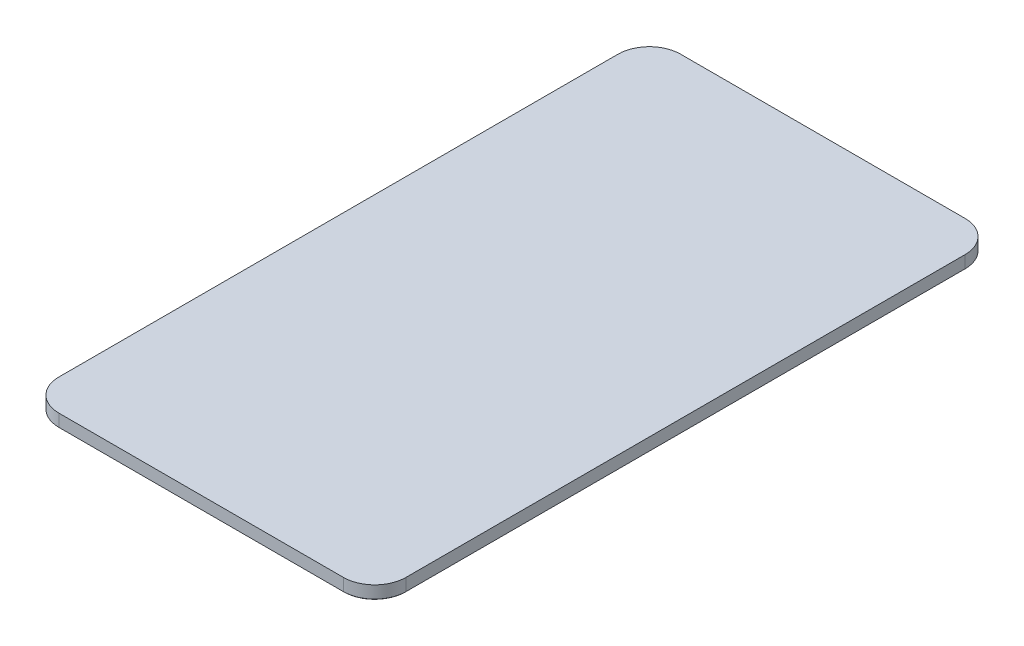
ISO-10303-21;
HEADER;
FILE_DESCRIPTION(('STEP AP214'),'2;1');
FILE_NAME('part.step','',(''),(''),'','','');
FILE_SCHEMA(('AUTOMOTIVE_DESIGN { 1 0 10303 214 1 1 1 1 }'));
ENDSEC;
DATA;
#1=APPLICATION_CONTEXT('core data for automotive mechanical design processes');
#2=APPLICATION_PROTOCOL_DEFINITION('international standard','automotive_design',2000,#1);
#3=PRODUCT_CONTEXT('',#1,'mechanical');
#4=PRODUCT('Part','Part','',(#3));
#5=PRODUCT_RELATED_PRODUCT_CATEGORY('part','',(#4));
#6=PRODUCT_DEFINITION_FORMATION('','',#4);
#7=PRODUCT_DEFINITION_CONTEXT('part definition',#1,'design');
#8=PRODUCT_DEFINITION('design','',#6,#7);
#9=PRODUCT_DEFINITION_SHAPE('','',#8);
#10=(LENGTH_UNIT() NAMED_UNIT(*) SI_UNIT(.MILLI.,.METRE.));
#11=(NAMED_UNIT(*) PLANE_ANGLE_UNIT() SI_UNIT($,.RADIAN.));
#12=(NAMED_UNIT(*) SI_UNIT($,.STERADIAN.) SOLID_ANGLE_UNIT());
#13=UNCERTAINTY_MEASURE_WITH_UNIT(LENGTH_MEASURE(1.E-05),#10,'distance_accuracy_value','');
#14=(GEOMETRIC_REPRESENTATION_CONTEXT(3) GLOBAL_UNCERTAINTY_ASSIGNED_CONTEXT((#13)) GLOBAL_UNIT_ASSIGNED_CONTEXT((#10,
#11,#12)) REPRESENTATION_CONTEXT('',''));
#15=CARTESIAN_POINT('',(0.,0.,0.));
#16=DIRECTION('',(0.,0.,1.));
#17=DIRECTION('',(1.,0.,0.));
#18=AXIS2_PLACEMENT_3D('',#15,#16,#17);
#19=CARTESIAN_POINT('',(0.,5.969,0.));
#20=DIRECTION('',(1.,0.,0.));
#21=DIRECTION('',(0.,0.,-1.));
#22=AXIS2_PLACEMENT_3D('',#19,#20,#21);
#23=PLANE('',#22);
#24=DIRECTION('',(0.,-1.,0.));
#25=VECTOR('',#24,1.);
#26=CARTESIAN_POINT('',(0.,5.969,-273.05));
#27=LINE('',#26,#25);
#28=CARTESIAN_POINT('',(0.,5.969,-273.05));
#29=VERTEX_POINT('',#28);
#30=CARTESIAN_POINT('',(0.,0.254000000000004,-273.05));
#31=VERTEX_POINT('',#30);
#32=EDGE_CURVE('E159',#29,#31,#27,.T.);
#33=ORIENTED_EDGE('',*,*,#32,.T.);
#34=DIRECTION('',(0.,0.,1.));
#35=VECTOR('',#34,1.);
#36=CARTESIAN_POINT('',(0.,0.254000000000004,-14.478));
#37=LINE('',#36,#35);
#38=CARTESIAN_POINT('',(0.,0.254000000000004,-14.478));
#39=VERTEX_POINT('',#38);
#40=EDGE_CURVE('E188',#31,#39,#37,.T.);
#41=ORIENTED_EDGE('',*,*,#40,.T.);
#42=DIRECTION('',(0.,-1.,0.));
#43=VECTOR('',#42,1.);
#44=CARTESIAN_POINT('',(0.,5.969,-14.478));
#45=LINE('',#44,#43);
#46=CARTESIAN_POINT('',(0.,5.969,-14.478));
#47=VERTEX_POINT('',#46);
#48=EDGE_CURVE('E162',#39,#47,#45,.F.);
#49=ORIENTED_EDGE('',*,*,#48,.T.);
#50=DIRECTION('',(0.,0.,1.));
#51=VECTOR('',#50,1.);
#52=CARTESIAN_POINT('',(0.,5.969,0.));
#53=LINE('',#52,#51);
#54=EDGE_CURVE('E217',#29,#47,#53,.T.);
#55=ORIENTED_EDGE('',*,*,#54,.F.);
#56=EDGE_LOOP('',(#33,#41,#49,#55));
#57=FACE_BOUND('',#56,.T.);
#58=ADVANCED_FACE('F34',(#57),#23,.F.);
#59=CARTESIAN_POINT('',(0.,5.969,0.));
#60=DIRECTION('',(0.,0.,-1.));
#61=DIRECTION('',(-1.,0.,0.));
#62=AXIS2_PLACEMENT_3D('',#59,#60,#61);
#63=PLANE('',#62);
#64=DIRECTION('',(0.,-1.,0.));
#65=VECTOR('',#64,1.);
#66=CARTESIAN_POINT('',(14.478,5.969,0.));
#67=LINE('',#66,#65);
#68=CARTESIAN_POINT('',(14.478,5.969,0.));
#69=VERTEX_POINT('',#68);
#70=CARTESIAN_POINT('',(14.478,0.254000000000004,0.));
#71=VERTEX_POINT('',#70);
#72=EDGE_CURVE('E132',#69,#71,#67,.T.);
#73=ORIENTED_EDGE('',*,*,#72,.T.);
#74=DIRECTION('',(1.,0.,0.));
#75=VECTOR('',#74,1.);
#76=CARTESIAN_POINT('',(146.05,0.254000000000004,0.));
#77=LINE('',#76,#75);
#78=CARTESIAN_POINT('',(146.05,0.254000000000004,0.));
#79=VERTEX_POINT('',#78);
#80=EDGE_CURVE('E184',#71,#79,#77,.T.);
#81=ORIENTED_EDGE('',*,*,#80,.T.);
#82=DIRECTION('',(0.,-1.,0.));
#83=VECTOR('',#82,1.);
#84=CARTESIAN_POINT('',(146.05,5.969,0.));
#85=LINE('',#84,#83);
#86=CARTESIAN_POINT('',(146.05,5.969,0.));
#87=VERTEX_POINT('',#86);
#88=EDGE_CURVE('E157',#79,#87,#85,.F.);
#89=ORIENTED_EDGE('',*,*,#88,.T.);
#90=DIRECTION('',(1.,0.,0.));
#91=VECTOR('',#90,1.);
#92=CARTESIAN_POINT('',(0.,5.969,0.));
#93=LINE('',#92,#91);
#94=EDGE_CURVE('E222',#69,#87,#93,.T.);
#95=ORIENTED_EDGE('',*,*,#94,.F.);
#96=EDGE_LOOP('',(#73,#81,#89,#95));
#97=FACE_BOUND('',#96,.T.);
#98=ADVANCED_FACE('F266',(#97),#63,.F.);
#99=CARTESIAN_POINT('',(160.528,5.969,0.));
#100=DIRECTION('',(-1.,0.,0.));
#101=DIRECTION('',(0.,0.,1.));
#102=AXIS2_PLACEMENT_3D('',#99,#100,#101);
#103=PLANE('',#102);
#104=DIRECTION('',(0.,-1.,0.));
#105=VECTOR('',#104,1.);
#106=CARTESIAN_POINT('',(160.528,5.969,-14.478));
#107=LINE('',#106,#105);
#108=CARTESIAN_POINT('',(160.528,5.969,-14.478));
#109=VERTEX_POINT('',#108);
#110=CARTESIAN_POINT('',(160.528,0.254000000000004,-14.478));
#111=VERTEX_POINT('',#110);
#112=EDGE_CURVE('E143',#109,#111,#107,.T.);
#113=ORIENTED_EDGE('',*,*,#112,.T.);
#114=DIRECTION('',(0.,0.,-1.));
#115=VECTOR('',#114,1.);
#116=CARTESIAN_POINT('',(160.528,0.254000000000004,-273.05));
#117=LINE('',#116,#115);
#118=CARTESIAN_POINT('',(160.528,0.254000000000004,-273.05));
#119=VERTEX_POINT('',#118);
#120=EDGE_CURVE('E11',#111,#119,#117,.T.);
#121=ORIENTED_EDGE('',*,*,#120,.T.);
#122=DIRECTION('',(0.,-1.,0.));
#123=VECTOR('',#122,1.);
#124=CARTESIAN_POINT('',(160.528,5.969,-273.05));
#125=LINE('',#124,#123);
#126=CARTESIAN_POINT('',(160.528,5.969,-273.05));
#127=VERTEX_POINT('',#126);
#128=EDGE_CURVE('E145',#119,#127,#125,.F.);
#129=ORIENTED_EDGE('',*,*,#128,.T.);
#130=DIRECTION('',(0.,0.,-1.));
#131=VECTOR('',#130,1.);
#132=CARTESIAN_POINT('',(160.528,5.969,0.));
#133=LINE('',#132,#131);
#134=EDGE_CURVE('E131',#109,#127,#133,.T.);
#135=ORIENTED_EDGE('',*,*,#134,.F.);
#136=EDGE_LOOP('',(#113,#121,#129,#135));
#137=FACE_BOUND('',#136,.T.);
#138=ADVANCED_FACE('F238',(#137),#103,.F.);
#139=CARTESIAN_POINT('',(0.,5.969,-287.528));
#140=DIRECTION('',(0.,0.,1.));
#141=DIRECTION('',(1.,0.,0.));
#142=AXIS2_PLACEMENT_3D('',#139,#140,#141);
#143=PLANE('',#142);
#144=DIRECTION('',(0.,-1.,0.));
#145=VECTOR('',#144,1.);
#146=CARTESIAN_POINT('',(146.05,5.969,-287.528));
#147=LINE('',#146,#145);
#148=CARTESIAN_POINT('',(146.05,5.969,-287.528));
#149=VERTEX_POINT('',#148);
#150=CARTESIAN_POINT('',(146.05,0.254000000000004,-287.528));
#151=VERTEX_POINT('',#150);
#152=EDGE_CURVE('E137',#149,#151,#147,.T.);
#153=ORIENTED_EDGE('',*,*,#152,.T.);
#154=DIRECTION('',(-1.,0.,0.));
#155=VECTOR('',#154,1.);
#156=CARTESIAN_POINT('',(14.478,0.254000000000004,-287.528));
#157=LINE('',#156,#155);
#158=CARTESIAN_POINT('',(14.478,0.254000000000004,-287.528));
#159=VERTEX_POINT('',#158);
#160=EDGE_CURVE('E192',#151,#159,#157,.T.);
#161=ORIENTED_EDGE('',*,*,#160,.T.);
#162=DIRECTION('',(0.,-1.,0.));
#163=VECTOR('',#162,1.);
#164=CARTESIAN_POINT('',(14.478,5.969,-287.528));
#165=LINE('',#164,#163);
#166=CARTESIAN_POINT('',(14.478,5.969,-287.528));
#167=VERTEX_POINT('',#166);
#168=EDGE_CURVE('E140',#159,#167,#165,.F.);
#169=ORIENTED_EDGE('',*,*,#168,.T.);
#170=DIRECTION('',(-1.,0.,0.));
#171=VECTOR('',#170,1.);
#172=CARTESIAN_POINT('',(0.,5.969,-287.528));
#173=LINE('',#172,#171);
#174=EDGE_CURVE('E128',#149,#167,#173,.T.);
#175=ORIENTED_EDGE('',*,*,#174,.F.);
#176=EDGE_LOOP('',(#153,#161,#169,#175));
#177=FACE_BOUND('',#176,.T.);
#178=ADVANCED_FACE('F136',(#177),#143,.F.);
#179=CARTESIAN_POINT('',(0.,5.969,0.));
#180=DIRECTION('',(0.,-1.,0.));
#181=DIRECTION('',(0.,0.,-1.));
#182=AXIS2_PLACEMENT_3D('',#179,#180,#181);
#183=PLANE('',#182);
#184=ORIENTED_EDGE('',*,*,#134,.T.);
#185=CARTESIAN_POINT('',(146.05,5.969,-273.05));
#186=DIRECTION('',(0.,-1.,0.));
#187=DIRECTION('',(0.,0.,-1.));
#188=AXIS2_PLACEMENT_3D('',#185,#186,#187);
#189=CIRCLE('',#188,14.478);
#190=EDGE_CURVE('E125',#127,#149,#189,.F.);
#191=ORIENTED_EDGE('',*,*,#190,.T.);
#192=ORIENTED_EDGE('',*,*,#174,.T.);
#193=CARTESIAN_POINT('',(14.478,5.969,-273.05));
#194=DIRECTION('',(0.,-1.,0.));
#195=DIRECTION('',(0.,0.,-1.));
#196=AXIS2_PLACEMENT_3D('',#193,#194,#195);
#197=CIRCLE('',#196,14.478);
#198=EDGE_CURVE('E150',#167,#29,#197,.F.);
#199=ORIENTED_EDGE('',*,*,#198,.T.);
#200=ORIENTED_EDGE('',*,*,#54,.T.);
#201=CARTESIAN_POINT('',(14.478,5.969,-14.478));
#202=DIRECTION('',(0.,-1.,0.));
#203=DIRECTION('',(0.,0.,-1.));
#204=AXIS2_PLACEMENT_3D('',#201,#202,#203);
#205=CIRCLE('',#204,14.478);
#206=EDGE_CURVE('E152',#47,#69,#205,.F.);
#207=ORIENTED_EDGE('',*,*,#206,.T.);
#208=ORIENTED_EDGE('',*,*,#94,.T.);
#209=CARTESIAN_POINT('',(146.05,5.969,-14.478));
#210=DIRECTION('',(0.,-1.,0.));
#211=DIRECTION('',(0.,0.,-1.));
#212=AXIS2_PLACEMENT_3D('',#209,#210,#211);
#213=CIRCLE('',#212,14.478);
#214=EDGE_CURVE('E133',#87,#109,#213,.F.);
#215=ORIENTED_EDGE('',*,*,#214,.T.);
#216=EDGE_LOOP('',(#184,#191,#192,#199,#200,#207,#208,#215));
#217=FACE_BOUND('',#216,.T.);
#218=ADVANCED_FACE('F127',(#217),#183,.F.);
#219=CARTESIAN_POINT('',(0.,0.,0.));
#220=DIRECTION('',(0.,-1.,0.));
#221=DIRECTION('',(0.,0.,-1.));
#222=AXIS2_PLACEMENT_3D('',#219,#220,#221);
#223=PLANE('',#222);
#224=DIRECTION('',(0.,0.,1.));
#225=VECTOR('',#224,1.);
#226=CARTESIAN_POINT('',(160.274,0.,-14.478));
#227=LINE('',#226,#225);
#228=CARTESIAN_POINT('',(160.274,0.,-273.05));
#229=VERTEX_POINT('',#228);
#230=CARTESIAN_POINT('',(160.274,0.,-14.478));
#231=VERTEX_POINT('',#230);
#232=EDGE_CURVE('E164',#229,#231,#227,.T.);
#233=ORIENTED_EDGE('',*,*,#232,.T.);
#234=CARTESIAN_POINT('',(146.05,0.,-14.478));
#235=DIRECTION('',(0.,-1.,0.));
#236=DIRECTION('',(0.,0.,-1.));
#237=AXIS2_PLACEMENT_3D('',#234,#235,#236);
#238=CIRCLE('',#237,14.224);
#239=CARTESIAN_POINT('',(146.05,0.,-0.254000000000004));
#240=VERTEX_POINT('',#239);
#241=EDGE_CURVE('E178',#231,#240,#238,.T.);
#242=ORIENTED_EDGE('',*,*,#241,.T.);
#243=DIRECTION('',(-1.,0.,0.));
#244=VECTOR('',#243,1.);
#245=CARTESIAN_POINT('',(14.478,0.,-0.254000000000004));
#246=LINE('',#245,#244);
#247=CARTESIAN_POINT('',(14.478,0.,-0.254000000000004));
#248=VERTEX_POINT('',#247);
#249=EDGE_CURVE('E176',#240,#248,#246,.T.);
#250=ORIENTED_EDGE('',*,*,#249,.T.);
#251=CARTESIAN_POINT('',(14.478,0.,-14.478));
#252=DIRECTION('',(0.,-1.,0.));
#253=DIRECTION('',(0.,0.,-1.));
#254=AXIS2_PLACEMENT_3D('',#251,#252,#253);
#255=CIRCLE('',#254,14.224);
#256=CARTESIAN_POINT('',(0.254000000000004,0.,-14.478));
#257=VERTEX_POINT('',#256);
#258=EDGE_CURVE('E174',#248,#257,#255,.T.);
#259=ORIENTED_EDGE('',*,*,#258,.T.);
#260=DIRECTION('',(0.,0.,-1.));
#261=VECTOR('',#260,1.);
#262=CARTESIAN_POINT('',(0.254000000000004,0.,-273.05));
#263=LINE('',#262,#261);
#264=CARTESIAN_POINT('',(0.253999999999983,0.,-273.05));
#265=VERTEX_POINT('',#264);
#266=EDGE_CURVE('E172',#257,#265,#263,.T.);
#267=ORIENTED_EDGE('',*,*,#266,.T.);
#268=CARTESIAN_POINT('',(14.478,0.,-273.05));
#269=DIRECTION('',(0.,-1.,0.));
#270=DIRECTION('',(0.,0.,-1.));
#271=AXIS2_PLACEMENT_3D('',#268,#269,#270);
#272=CIRCLE('',#271,14.224);
#273=CARTESIAN_POINT('',(14.478,0.,-287.274));
#274=VERTEX_POINT('',#273);
#275=EDGE_CURVE('E170',#265,#274,#272,.T.);
#276=ORIENTED_EDGE('',*,*,#275,.T.);
#277=DIRECTION('',(1.,0.,0.));
#278=VECTOR('',#277,1.);
#279=CARTESIAN_POINT('',(146.05,0.,-287.274));
#280=LINE('',#279,#278);
#281=CARTESIAN_POINT('',(146.05,0.,-287.274));
#282=VERTEX_POINT('',#281);
#283=EDGE_CURVE('E168',#274,#282,#280,.T.);
#284=ORIENTED_EDGE('',*,*,#283,.T.);
#285=CARTESIAN_POINT('',(146.05,0.,-273.05));
#286=DIRECTION('',(0.,-1.,0.));
#287=DIRECTION('',(0.,0.,-1.));
#288=AXIS2_PLACEMENT_3D('',#285,#286,#287);
#289=CIRCLE('',#288,14.224);
#290=EDGE_CURVE('E166',#282,#229,#289,.T.);
#291=ORIENTED_EDGE('',*,*,#290,.T.);
#292=EDGE_LOOP('',(#233,#242,#250,#259,#267,#276,#284,#291));
#293=FACE_BOUND('',#292,.T.);
#294=ADVANCED_FACE('F250',(#293),#223,.T.);
#295=CARTESIAN_POINT('',(146.05,5.969,-273.05));
#296=DIRECTION('',(0.,-1.,0.));
#297=DIRECTION('',(0.,0.,-1.));
#298=AXIS2_PLACEMENT_3D('',#295,#296,#297);
#299=CYLINDRICAL_SURFACE('',#298,14.478);
#300=ORIENTED_EDGE('',*,*,#128,.F.);
#301=CARTESIAN_POINT('',(146.05,0.254000000000004,-273.05));
#302=DIRECTION('',(0.,-1.,0.));
#303=DIRECTION('',(0.,0.,-1.));
#304=AXIS2_PLACEMENT_3D('',#301,#302,#303);
#305=CIRCLE('',#304,14.478);
#306=EDGE_CURVE('E43',#119,#151,#305,.F.);
#307=ORIENTED_EDGE('',*,*,#306,.T.);
#308=ORIENTED_EDGE('',*,*,#152,.F.);
#309=ORIENTED_EDGE('',*,*,#190,.F.);
#310=EDGE_LOOP('',(#300,#307,#308,#309));
#311=FACE_BOUND('',#310,.T.);
#312=ADVANCED_FACE('F142',(#311),#299,.T.);
#313=CARTESIAN_POINT('',(146.05,5.969,-14.478));
#314=DIRECTION('',(0.,-1.,0.));
#315=DIRECTION('',(0.,0.,-1.));
#316=AXIS2_PLACEMENT_3D('',#313,#314,#315);
#317=CYLINDRICAL_SURFACE('',#316,14.478);
#318=ORIENTED_EDGE('',*,*,#88,.F.);
#319=CARTESIAN_POINT('',(146.05,0.254000000000004,-14.478));
#320=DIRECTION('',(0.,-1.,0.));
#321=DIRECTION('',(0.,0.,-1.));
#322=AXIS2_PLACEMENT_3D('',#319,#320,#321);
#323=CIRCLE('',#322,14.478);
#324=EDGE_CURVE('E181',#79,#111,#323,.F.);
#325=ORIENTED_EDGE('',*,*,#324,.T.);
#326=ORIENTED_EDGE('',*,*,#112,.F.);
#327=ORIENTED_EDGE('',*,*,#214,.F.);
#328=EDGE_LOOP('',(#318,#325,#326,#327));
#329=FACE_BOUND('',#328,.T.);
#330=ADVANCED_FACE('F236',(#329),#317,.T.);
#331=CARTESIAN_POINT('',(14.478,5.969,-14.478));
#332=DIRECTION('',(0.,-1.,0.));
#333=DIRECTION('',(0.,0.,-1.));
#334=AXIS2_PLACEMENT_3D('',#331,#332,#333);
#335=CYLINDRICAL_SURFACE('',#334,14.478);
#336=ORIENTED_EDGE('',*,*,#48,.F.);
#337=CARTESIAN_POINT('',(14.478,0.254000000000004,-14.478));
#338=DIRECTION('',(0.,-1.,0.));
#339=DIRECTION('',(0.,0.,-1.));
#340=AXIS2_PLACEMENT_3D('',#337,#338,#339);
#341=CIRCLE('',#340,14.478);
#342=EDGE_CURVE('E186',#39,#71,#341,.F.);
#343=ORIENTED_EDGE('',*,*,#342,.T.);
#344=ORIENTED_EDGE('',*,*,#72,.F.);
#345=ORIENTED_EDGE('',*,*,#206,.F.);
#346=EDGE_LOOP('',(#336,#343,#344,#345));
#347=FACE_BOUND('',#346,.T.);
#348=ADVANCED_FACE('F264',(#347),#335,.T.);
#349=CARTESIAN_POINT('',(14.478,5.969,-273.05));
#350=DIRECTION('',(0.,-1.,0.));
#351=DIRECTION('',(0.,0.,-1.));
#352=AXIS2_PLACEMENT_3D('',#349,#350,#351);
#353=CYLINDRICAL_SURFACE('',#352,14.478);
#354=ORIENTED_EDGE('',*,*,#168,.F.);
#355=CARTESIAN_POINT('',(14.478,0.254000000000004,-273.05));
#356=DIRECTION('',(0.,-1.,0.));
#357=DIRECTION('',(0.,0.,-1.));
#358=AXIS2_PLACEMENT_3D('',#355,#356,#357);
#359=CIRCLE('',#358,14.478);
#360=EDGE_CURVE('E190',#159,#31,#359,.F.);
#361=ORIENTED_EDGE('',*,*,#360,.T.);
#362=ORIENTED_EDGE('',*,*,#32,.F.);
#363=ORIENTED_EDGE('',*,*,#198,.F.);
#364=EDGE_LOOP('',(#354,#361,#362,#363));
#365=FACE_BOUND('',#364,.T.);
#366=ADVANCED_FACE('F255',(#365),#353,.T.);
#367=CARTESIAN_POINT('',(14.478,0.,-273.05));
#368=DIRECTION('',(0.,1.,0.));
#369=DIRECTION('',(0.,0.,1.));
#370=AXIS2_PLACEMENT_3D('',#367,#368,#369);
#371=CONICAL_SURFACE('',#370,14.224,0.785398163397448);
#372=DIRECTION('',(0.707106781186518,-0.707106781186576,0.));
#373=VECTOR('',#372,1.);
#374=CARTESIAN_POINT('',(0.,0.254000000000004,-273.05));
#375=LINE('',#374,#373);
#376=EDGE_CURVE('E210',#31,#265,#375,.T.);
#377=ORIENTED_EDGE('',*,*,#376,.F.);
#378=ORIENTED_EDGE('',*,*,#360,.F.);
#379=DIRECTION('',(0.,0.707106781186586,-0.707106781186509));
#380=VECTOR('',#379,1.);
#381=CARTESIAN_POINT('',(14.478,0.,-287.274));
#382=LINE('',#381,#380);
#383=EDGE_CURVE('E38',#274,#159,#382,.T.);
#384=ORIENTED_EDGE('',*,*,#383,.F.);
#385=ORIENTED_EDGE('',*,*,#275,.F.);
#386=EDGE_LOOP('',(#377,#378,#384,#385));
#387=FACE_BOUND('',#386,.T.);
#388=ADVANCED_FACE('F36',(#387),#371,.T.);
#389=CARTESIAN_POINT('',(0.,0.254000000000004,-287.528));
#390=DIRECTION('',(0.,-0.707106781186509,-0.707106781186586));
#391=DIRECTION('',(1.,0.,0.));
#392=AXIS2_PLACEMENT_3D('',#389,#390,#391);
#393=PLANE('',#392);
#394=ORIENTED_EDGE('',*,*,#383,.T.);
#395=ORIENTED_EDGE('',*,*,#160,.F.);
#396=DIRECTION('',(0.,0.707106781186586,-0.707106781186509));
#397=VECTOR('',#396,1.);
#398=CARTESIAN_POINT('',(146.05,0.,-287.274));
#399=LINE('',#398,#397);
#400=EDGE_CURVE('E208',#282,#151,#399,.T.);
#401=ORIENTED_EDGE('',*,*,#400,.F.);
#402=ORIENTED_EDGE('',*,*,#283,.F.);
#403=EDGE_LOOP('',(#394,#395,#401,#402));
#404=FACE_BOUND('',#403,.T.);
#405=ADVANCED_FACE('F252',(#404),#393,.T.);
#406=CARTESIAN_POINT('',(0.,0.254000000000004,0.));
#407=DIRECTION('',(-0.707106781186547,-0.707106781186547,0.));
#408=DIRECTION('',(0.,0.,-1.));
#409=AXIS2_PLACEMENT_3D('',#406,#407,#408);
#410=PLANE('',#409);
#411=ORIENTED_EDGE('',*,*,#376,.T.);
#412=ORIENTED_EDGE('',*,*,#266,.F.);
#413=DIRECTION('',(0.707106781186547,-0.707106781186547,0.));
#414=VECTOR('',#413,1.);
#415=CARTESIAN_POINT('',(0.,0.254000000000004,-14.478));
#416=LINE('',#415,#414);
#417=EDGE_CURVE('E205',#39,#257,#416,.T.);
#418=ORIENTED_EDGE('',*,*,#417,.F.);
#419=ORIENTED_EDGE('',*,*,#40,.F.);
#420=EDGE_LOOP('',(#411,#412,#418,#419));
#421=FACE_BOUND('',#420,.T.);
#422=ADVANCED_FACE('F259',(#421),#410,.T.);
#423=CARTESIAN_POINT('',(146.05,0.,-273.05));
#424=DIRECTION('',(0.,1.,0.));
#425=DIRECTION('',(0.,0.,1.));
#426=AXIS2_PLACEMENT_3D('',#423,#424,#425);
#427=CONICAL_SURFACE('',#426,14.224,0.785398163397407);
#428=ORIENTED_EDGE('',*,*,#400,.T.);
#429=ORIENTED_EDGE('',*,*,#306,.F.);
#430=DIRECTION('',(0.707106781186509,0.707106781186586,0.));
#431=VECTOR('',#430,1.);
#432=CARTESIAN_POINT('',(160.274,0.,-273.05));
#433=LINE('',#432,#431);
#434=EDGE_CURVE('E202',#229,#119,#433,.T.);
#435=ORIENTED_EDGE('',*,*,#434,.F.);
#436=ORIENTED_EDGE('',*,*,#290,.F.);
#437=EDGE_LOOP('',(#428,#429,#435,#436));
#438=FACE_BOUND('',#437,.T.);
#439=ADVANCED_FACE('F241',(#438),#427,.T.);
#440=CARTESIAN_POINT('',(14.478,0.,-14.478));
#441=DIRECTION('',(0.,1.,0.));
#442=DIRECTION('',(0.,0.,1.));
#443=AXIS2_PLACEMENT_3D('',#440,#441,#442);
#444=CONICAL_SURFACE('',#443,14.224,0.785398163397448);
#445=ORIENTED_EDGE('',*,*,#417,.T.);
#446=ORIENTED_EDGE('',*,*,#258,.F.);
#447=DIRECTION('',(0.,-0.707106781186547,-0.707106781186547));
#448=VECTOR('',#447,1.);
#449=CARTESIAN_POINT('',(14.478,0.254000000000004,0.));
#450=LINE('',#449,#448);
#451=EDGE_CURVE('E199',#71,#248,#450,.T.);
#452=ORIENTED_EDGE('',*,*,#451,.F.);
#453=ORIENTED_EDGE('',*,*,#342,.F.);
#454=EDGE_LOOP('',(#445,#446,#452,#453));
#455=FACE_BOUND('',#454,.T.);
#456=ADVANCED_FACE('F270',(#455),#444,.T.);
#457=CARTESIAN_POINT('',(160.528,0.254000000000004,0.));
#458=DIRECTION('',(0.707106781186547,-0.707106781186547,0.));
#459=DIRECTION('',(0.,0.,1.));
#460=AXIS2_PLACEMENT_3D('',#457,#458,#459);
#461=PLANE('',#460);
#462=ORIENTED_EDGE('',*,*,#434,.T.);
#463=ORIENTED_EDGE('',*,*,#120,.F.);
#464=DIRECTION('',(0.707106781186547,0.707106781186547,0.));
#465=VECTOR('',#464,1.);
#466=CARTESIAN_POINT('',(160.274,0.,-14.478));
#467=LINE('',#466,#465);
#468=EDGE_CURVE('E197',#231,#111,#467,.T.);
#469=ORIENTED_EDGE('',*,*,#468,.F.);
#470=ORIENTED_EDGE('',*,*,#232,.F.);
#471=EDGE_LOOP('',(#462,#463,#469,#470));
#472=FACE_BOUND('',#471,.T.);
#473=ADVANCED_FACE('F246',(#472),#461,.T.);
#474=CARTESIAN_POINT('',(0.,0.254000000000004,0.));
#475=DIRECTION('',(0.,-0.707106781186547,0.707106781186547));
#476=DIRECTION('',(-1.,0.,0.));
#477=AXIS2_PLACEMENT_3D('',#474,#475,#476);
#478=PLANE('',#477);
#479=ORIENTED_EDGE('',*,*,#451,.T.);
#480=ORIENTED_EDGE('',*,*,#249,.F.);
#481=DIRECTION('',(0.,-0.707106781186547,-0.707106781186547));
#482=VECTOR('',#481,1.);
#483=CARTESIAN_POINT('',(146.05,0.254000000000004,0.));
#484=LINE('',#483,#482);
#485=EDGE_CURVE('E195',#79,#240,#484,.T.);
#486=ORIENTED_EDGE('',*,*,#485,.F.);
#487=ORIENTED_EDGE('',*,*,#80,.F.);
#488=EDGE_LOOP('',(#479,#480,#486,#487));
#489=FACE_BOUND('',#488,.T.);
#490=ADVANCED_FACE('F274',(#489),#478,.T.);
#491=CARTESIAN_POINT('',(146.05,0.,-14.478));
#492=DIRECTION('',(0.,1.,0.));
#493=DIRECTION('',(0.,0.,1.));
#494=AXIS2_PLACEMENT_3D('',#491,#492,#493);
#495=CONICAL_SURFACE('',#494,14.224,0.785398163397462);
#496=ORIENTED_EDGE('',*,*,#468,.T.);
#497=ORIENTED_EDGE('',*,*,#324,.F.);
#498=ORIENTED_EDGE('',*,*,#485,.T.);
#499=ORIENTED_EDGE('',*,*,#241,.F.);
#500=EDGE_LOOP('',(#496,#497,#498,#499));
#501=FACE_BOUND('',#500,.T.);
#502=ADVANCED_FACE('F276',(#501),#495,.T.);
#503=CLOSED_SHELL('',(#58,#98,#138,#178,#218,#294,#312,#330,#348,#366,#388,#405,#422,#439,#456,
#473,#490,#502));
#504=MANIFOLD_SOLID_BREP('B2',#503);
#505=ADVANCED_BREP_SHAPE_REPRESENTATION('',(#18,#504),#14);
#506=SHAPE_DEFINITION_REPRESENTATION(#9,#505);
ENDSEC;
END-ISO-10303-21;
